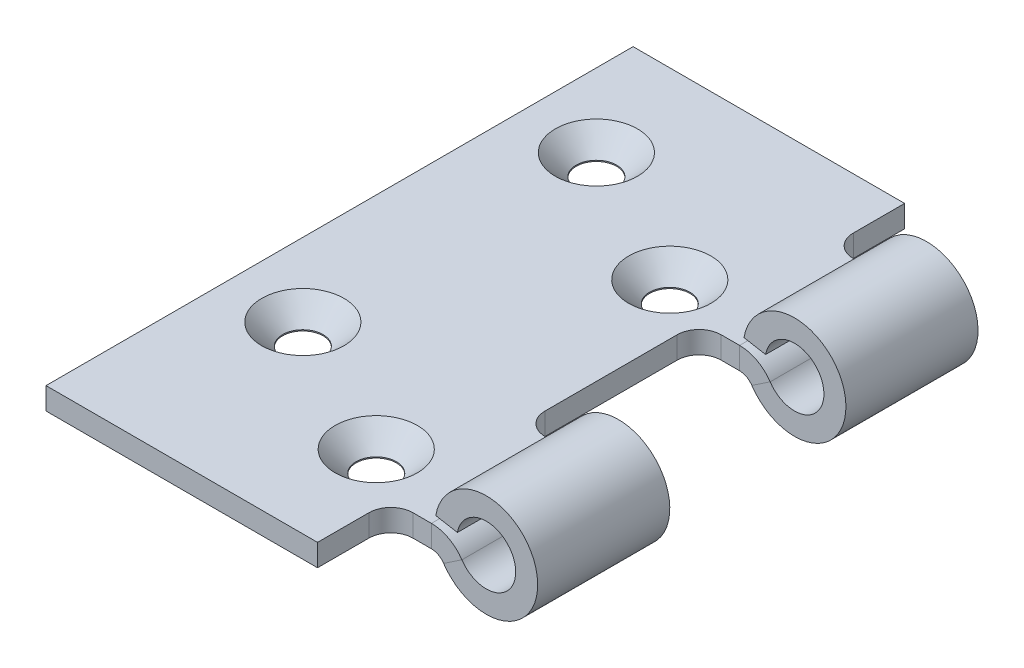
ISO-10303-21;
HEADER;
FILE_DESCRIPTION(('STEP AP214'),'2;1');
FILE_NAME('part.step','',(''),(''),'','','');
FILE_SCHEMA(('AUTOMOTIVE_DESIGN { 1 0 10303 214 1 1 1 1 }'));
ENDSEC;
DATA;
#1=APPLICATION_CONTEXT('core data for automotive mechanical design processes');
#2=APPLICATION_PROTOCOL_DEFINITION('international standard','automotive_design',2000,#1);
#3=PRODUCT_CONTEXT('',#1,'mechanical');
#4=PRODUCT('Part','Part','',(#3));
#5=PRODUCT_RELATED_PRODUCT_CATEGORY('part','',(#4));
#6=PRODUCT_DEFINITION_FORMATION('','',#4);
#7=PRODUCT_DEFINITION_CONTEXT('part definition',#1,'design');
#8=PRODUCT_DEFINITION('design','',#6,#7);
#9=PRODUCT_DEFINITION_SHAPE('','',#8);
#10=(LENGTH_UNIT() NAMED_UNIT(*) SI_UNIT(.MILLI.,.METRE.));
#11=(NAMED_UNIT(*) PLANE_ANGLE_UNIT() SI_UNIT($,.RADIAN.));
#12=(NAMED_UNIT(*) SI_UNIT($,.STERADIAN.) SOLID_ANGLE_UNIT());
#13=UNCERTAINTY_MEASURE_WITH_UNIT(LENGTH_MEASURE(1.E-05),#10,'distance_accuracy_value','');
#14=(GEOMETRIC_REPRESENTATION_CONTEXT(3) GLOBAL_UNCERTAINTY_ASSIGNED_CONTEXT((#13)) GLOBAL_UNIT_ASSIGNED_CONTEXT((#10,
#11,#12)) REPRESENTATION_CONTEXT('',''));
#15=CARTESIAN_POINT('',(0.,0.,0.));
#16=DIRECTION('',(0.,0.,1.));
#17=DIRECTION('',(1.,0.,0.));
#18=AXIS2_PLACEMENT_3D('',#15,#16,#17);
#19=CARTESIAN_POINT('',(-9.99999999999993,-6.99999999999995,-70.));
#20=DIRECTION('',(0.,0.,1.));
#21=DIRECTION('',(1.,0.,0.));
#22=AXIS2_PLACEMENT_3D('',#19,#20,#21);
#23=PLANE('',#22);
#24=CARTESIAN_POINT('',(0.,0.,-70.));
#25=DIRECTION('',(0.,0.,1.));
#26=DIRECTION('',(1.,0.,0.));
#27=AXIS2_PLACEMENT_3D('',#24,#25,#26);
#28=CIRCLE('',#27,7.00000000000001);
#29=CARTESIAN_POINT('',(-6.89365427108544,1.21553724366846,-70.));
#30=VERTEX_POINT('',#29);
#31=CARTESIAN_POINT('',(-5.82035593498165,-3.88888888888883,-70.));
#32=VERTEX_POINT('',#31);
#33=EDGE_CURVE('E276',#30,#32,#28,.F.);
#34=ORIENTED_EDGE('',*,*,#33,.T.);
#35=DIRECTION('',(0.831479419283094,0.555555555555562,0.));
#36=VECTOR('',#35,1.);
#37=CARTESIAN_POINT('',(-5.82035593498165,-3.88888888888883,-70.));
#38=LINE('',#37,#36);
#39=CARTESIAN_POINT('',(-3.32591767713236,-2.22222222222215,-70.));
#40=VERTEX_POINT('',#39);
#41=EDGE_CURVE('E12',#32,#40,#38,.T.);
#42=ORIENTED_EDGE('',*,*,#41,.T.);
#43=CARTESIAN_POINT('',(0.,0.,-70.));
#44=DIRECTION('',(0.,0.,1.));
#45=DIRECTION('',(1.,0.,0.));
#46=AXIS2_PLACEMENT_3D('',#43,#44,#45);
#47=CIRCLE('',#46,4.00000000000001);
#48=CARTESIAN_POINT('',(-3.9392310120488,0.694592710667715,-70.));
#49=VERTEX_POINT('',#48);
#50=EDGE_CURVE('E214',#49,#40,#47,.F.);
#51=ORIENTED_EDGE('',*,*,#50,.F.);
#52=DIRECTION('',(-0.984807753012211,0.173648177666914,0.));
#53=VECTOR('',#52,1.);
#54=CARTESIAN_POINT('',(-4.57147758948264,0.806074840729873,-70.));
#55=LINE('',#54,#53);
#56=EDGE_CURVE('E269',#49,#30,#55,.T.);
#57=ORIENTED_EDGE('',*,*,#56,.T.);
#58=EDGE_LOOP('',(#34,#42,#51,#57));
#59=FACE_BOUND('',#58,.T.);
#60=ADVANCED_FACE('F42',(#59),#23,.F.);
#61=DIRECTION('',(-1.,0.,0.));
#62=VECTOR('',#61,1.);
#63=CARTESIAN_POINT('',(-50.,0.,-70.));
#64=LINE('',#63,#62);
#65=CARTESIAN_POINT('',(-7.48331477354785,0.,-70.));
#66=VERTEX_POINT('',#65);
#67=CARTESIAN_POINT('',(-9.99999999999993,0.,-70.));
#68=VERTEX_POINT('',#67);
#69=EDGE_CURVE('E273',#66,#68,#64,.T.);
#70=ORIENTED_EDGE('',*,*,#69,.F.);
#71=DIRECTION('',(0.,-1.,0.));
#72=VECTOR('',#71,1.);
#73=CARTESIAN_POINT('',(-7.48331477354785,0.,-70.));
#74=LINE('',#73,#72);
#75=CARTESIAN_POINT('',(-7.48331477354785,-2.99999999999993,-70.));
#76=VERTEX_POINT('',#75);
#77=EDGE_CURVE('E50',#66,#76,#74,.T.);
#78=ORIENTED_EDGE('',*,*,#77,.T.);
#79=DIRECTION('',(1.,0.,0.));
#80=VECTOR('',#79,1.);
#81=CARTESIAN_POINT('',(-7.48331477354785,-2.99999999999993,-70.));
#82=LINE('',#81,#80);
#83=CARTESIAN_POINT('',(-9.99999999999993,-2.99999999999993,-70.));
#84=VERTEX_POINT('',#83);
#85=EDGE_CURVE('E281',#84,#76,#82,.T.);
#86=ORIENTED_EDGE('',*,*,#85,.F.);
#87=DIRECTION('',(0.,1.,0.));
#88=VECTOR('',#87,1.);
#89=CARTESIAN_POINT('',(-9.99999999999993,-6.99999999999995,-70.));
#90=LINE('',#89,#88);
#91=EDGE_CURVE('E520',#84,#68,#90,.T.);
#92=ORIENTED_EDGE('',*,*,#91,.T.);
#93=EDGE_LOOP('',(#70,#78,#86,#92));
#94=FACE_BOUND('',#93,.T.);
#95=ADVANCED_FACE('F423',(#94),#23,.F.);
#96=CARTESIAN_POINT('',(-9.99999999999993,-6.99999999999995,-52.));
#97=DIRECTION('',(0.,0.,-1.));
#98=DIRECTION('',(-1.,0.,0.));
#99=AXIS2_PLACEMENT_3D('',#96,#97,#98);
#100=PLANE('',#99);
#101=CARTESIAN_POINT('',(0.,0.,-52.));
#102=DIRECTION('',(0.,0.,-1.));
#103=DIRECTION('',(-1.,0.,0.));
#104=AXIS2_PLACEMENT_3D('',#101,#102,#103);
#105=CIRCLE('',#104,4.00000000000001);
#106=CARTESIAN_POINT('',(-3.32591767713236,-2.22222222222215,-52.));
#107=VERTEX_POINT('',#106);
#108=CARTESIAN_POINT('',(-3.9392310120488,0.694592710667715,-52.));
#109=VERTEX_POINT('',#108);
#110=EDGE_CURVE('E390',#107,#109,#105,.F.);
#111=ORIENTED_EDGE('',*,*,#110,.F.);
#112=DIRECTION('',(-0.831479419283094,-0.555555555555562,0.));
#113=VECTOR('',#112,1.);
#114=CARTESIAN_POINT('',(-3.32591767713236,-2.22222222222215,-52.));
#115=LINE('',#114,#113);
#116=CARTESIAN_POINT('',(-5.82035593498165,-3.88888888888883,-52.));
#117=VERTEX_POINT('',#116);
#118=EDGE_CURVE('E419',#107,#117,#115,.T.);
#119=ORIENTED_EDGE('',*,*,#118,.T.);
#120=CARTESIAN_POINT('',(0.,0.,-52.));
#121=DIRECTION('',(0.,0.,-1.));
#122=DIRECTION('',(-1.,0.,0.));
#123=AXIS2_PLACEMENT_3D('',#120,#121,#122);
#124=CIRCLE('',#123,7.00000000000001);
#125=CARTESIAN_POINT('',(-6.89365427108544,1.21553724366846,-52.));
#126=VERTEX_POINT('',#125);
#127=EDGE_CURVE('E245',#117,#126,#124,.F.);
#128=ORIENTED_EDGE('',*,*,#127,.T.);
#129=DIRECTION('',(0.984807753012211,-0.173648177666914,0.));
#130=VECTOR('',#129,1.);
#131=CARTESIAN_POINT('',(-4.57147758948264,0.806074840729873,-52.));
#132=LINE('',#131,#130);
#133=EDGE_CURVE('E231',#126,#109,#132,.T.);
#134=ORIENTED_EDGE('',*,*,#133,.T.);
#135=EDGE_LOOP('',(#111,#119,#128,#134));
#136=FACE_BOUND('',#135,.T.);
#137=ADVANCED_FACE('F447',(#136),#100,.F.);
#138=DIRECTION('',(-1.,0.,0.));
#139=VECTOR('',#138,1.);
#140=CARTESIAN_POINT('',(-7.48331477354785,-2.99999999999993,-52.));
#141=LINE('',#140,#139);
#142=CARTESIAN_POINT('',(-7.48331477354785,-2.99999999999993,-52.));
#143=VERTEX_POINT('',#142);
#144=CARTESIAN_POINT('',(-9.99999999999993,-2.99999999999993,-52.));
#145=VERTEX_POINT('',#144);
#146=EDGE_CURVE('E250',#143,#145,#141,.T.);
#147=ORIENTED_EDGE('',*,*,#146,.F.);
#148=DIRECTION('',(0.,1.,0.));
#149=VECTOR('',#148,1.);
#150=CARTESIAN_POINT('',(-7.48331477354785,-2.99999999999993,-52.));
#151=LINE('',#150,#149);
#152=CARTESIAN_POINT('',(-7.48331477354785,0.,-52.));
#153=VERTEX_POINT('',#152);
#154=EDGE_CURVE('E417',#143,#153,#151,.T.);
#155=ORIENTED_EDGE('',*,*,#154,.T.);
#156=DIRECTION('',(1.,0.,0.));
#157=VECTOR('',#156,1.);
#158=CARTESIAN_POINT('',(-50.,0.,-52.));
#159=LINE('',#158,#157);
#160=CARTESIAN_POINT('',(-9.99999999999993,0.,-52.));
#161=VERTEX_POINT('',#160);
#162=EDGE_CURVE('E242',#161,#153,#159,.T.);
#163=ORIENTED_EDGE('',*,*,#162,.F.);
#164=DIRECTION('',(0.,1.,0.));
#165=VECTOR('',#164,1.);
#166=CARTESIAN_POINT('',(-9.99999999999993,-6.99999999999995,-52.));
#167=LINE('',#166,#165);
#168=EDGE_CURVE('E467',#145,#161,#167,.T.);
#169=ORIENTED_EDGE('',*,*,#168,.F.);
#170=EDGE_LOOP('',(#147,#155,#163,#169));
#171=FACE_BOUND('',#170,.T.);
#172=ADVANCED_FACE('F466',(#171),#100,.F.);
#173=CARTESIAN_POINT('',(-9.99999999999993,-6.99999999999995,-28.));
#174=DIRECTION('',(0.,0.,1.));
#175=DIRECTION('',(1.,0.,0.));
#176=AXIS2_PLACEMENT_3D('',#173,#174,#175);
#177=PLANE('',#176);
#178=CARTESIAN_POINT('',(0.,0.,-28.));
#179=DIRECTION('',(0.,0.,1.));
#180=DIRECTION('',(1.,0.,0.));
#181=AXIS2_PLACEMENT_3D('',#178,#179,#180);
#182=CIRCLE('',#181,7.00000000000001);
#183=CARTESIAN_POINT('',(-6.89365427108544,1.21553724366846,-28.));
#184=VERTEX_POINT('',#183);
#185=CARTESIAN_POINT('',(-5.82035593498165,-3.88888888888883,-28.));
#186=VERTEX_POINT('',#185);
#187=EDGE_CURVE('E261',#184,#186,#182,.F.);
#188=ORIENTED_EDGE('',*,*,#187,.T.);
#189=DIRECTION('',(0.831479419283094,0.555555555555562,0.));
#190=VECTOR('',#189,1.);
#191=CARTESIAN_POINT('',(-5.82035593498165,-3.88888888888883,-28.));
#192=LINE('',#191,#190);
#193=CARTESIAN_POINT('',(-3.32591767713236,-2.22222222222215,-28.));
#194=VERTEX_POINT('',#193);
#195=EDGE_CURVE('E415',#186,#194,#192,.T.);
#196=ORIENTED_EDGE('',*,*,#195,.T.);
#197=CARTESIAN_POINT('',(0.,0.,-28.));
#198=DIRECTION('',(0.,0.,1.));
#199=DIRECTION('',(1.,0.,0.));
#200=AXIS2_PLACEMENT_3D('',#197,#198,#199);
#201=CIRCLE('',#200,4.00000000000001);
#202=CARTESIAN_POINT('',(-3.9392310120488,0.694592710667715,-28.));
#203=VERTEX_POINT('',#202);
#204=EDGE_CURVE('E393',#203,#194,#201,.F.);
#205=ORIENTED_EDGE('',*,*,#204,.F.);
#206=DIRECTION('',(-0.984807753012211,0.173648177666914,0.));
#207=VECTOR('',#206,1.);
#208=CARTESIAN_POINT('',(-4.57147758948264,0.806074840729873,-28.));
#209=LINE('',#208,#207);
#210=EDGE_CURVE('E253',#203,#184,#209,.T.);
#211=ORIENTED_EDGE('',*,*,#210,.T.);
#212=EDGE_LOOP('',(#188,#196,#205,#211));
#213=FACE_BOUND('',#212,.T.);
#214=ADVANCED_FACE('F501',(#213),#177,.F.);
#215=DIRECTION('',(-1.,0.,0.));
#216=VECTOR('',#215,1.);
#217=CARTESIAN_POINT('',(-50.,0.,-28.));
#218=LINE('',#217,#216);
#219=CARTESIAN_POINT('',(-7.48331477354785,0.,-28.));
#220=VERTEX_POINT('',#219);
#221=CARTESIAN_POINT('',(-9.99999999999993,0.,-28.));
#222=VERTEX_POINT('',#221);
#223=EDGE_CURVE('E258',#220,#222,#218,.T.);
#224=ORIENTED_EDGE('',*,*,#223,.F.);
#225=DIRECTION('',(0.,-1.,0.));
#226=VECTOR('',#225,1.);
#227=CARTESIAN_POINT('',(-7.48331477354785,0.,-28.));
#228=LINE('',#227,#226);
#229=CARTESIAN_POINT('',(-7.48331477354785,-2.99999999999993,-28.));
#230=VERTEX_POINT('',#229);
#231=EDGE_CURVE('E413',#220,#230,#228,.T.);
#232=ORIENTED_EDGE('',*,*,#231,.T.);
#233=DIRECTION('',(1.,0.,0.));
#234=VECTOR('',#233,1.);
#235=CARTESIAN_POINT('',(-7.48331477354785,-2.99999999999993,-28.));
#236=LINE('',#235,#234);
#237=CARTESIAN_POINT('',(-9.99999999999993,-2.99999999999993,-28.));
#238=VERTEX_POINT('',#237);
#239=EDGE_CURVE('E267',#238,#230,#236,.T.);
#240=ORIENTED_EDGE('',*,*,#239,.F.);
#241=DIRECTION('',(0.,1.,0.));
#242=VECTOR('',#241,1.);
#243=CARTESIAN_POINT('',(-9.99999999999993,-6.99999999999995,-28.));
#244=LINE('',#243,#242);
#245=EDGE_CURVE('E512',#238,#222,#244,.T.);
#246=ORIENTED_EDGE('',*,*,#245,.T.);
#247=EDGE_LOOP('',(#224,#232,#240,#246));
#248=FACE_BOUND('',#247,.T.);
#249=ADVANCED_FACE('F511',(#248),#177,.F.);
#250=CARTESIAN_POINT('',(-9.99999999999992,-6.99999999999995,-9.99999999999999));
#251=DIRECTION('',(0.,0.,-1.));
#252=DIRECTION('',(-1.,0.,0.));
#253=AXIS2_PLACEMENT_3D('',#250,#251,#252);
#254=PLANE('',#253);
#255=CARTESIAN_POINT('',(0.,0.,-9.99999999999999));
#256=DIRECTION('',(0.,0.,-1.));
#257=DIRECTION('',(-1.,0.,0.));
#258=AXIS2_PLACEMENT_3D('',#255,#256,#257);
#259=CIRCLE('',#258,4.00000000000001);
#260=CARTESIAN_POINT('',(-3.32591767713236,-2.22222222222215,-9.99999999999999));
#261=VERTEX_POINT('',#260);
#262=CARTESIAN_POINT('',(-3.9392310120488,0.694592710667715,-9.99999999999999));
#263=VERTEX_POINT('',#262);
#264=EDGE_CURVE('E388',#261,#263,#259,.F.);
#265=ORIENTED_EDGE('',*,*,#264,.F.);
#266=DIRECTION('',(-0.831479419283094,-0.555555555555562,0.));
#267=VECTOR('',#266,1.);
#268=CARTESIAN_POINT('',(-3.32591767713236,-2.22222222222215,-9.99999999999999));
#269=LINE('',#268,#267);
#270=CARTESIAN_POINT('',(-5.82035593498165,-3.88888888888883,-9.99999999999999));
#271=VERTEX_POINT('',#270);
#272=EDGE_CURVE('E411',#261,#271,#269,.T.);
#273=ORIENTED_EDGE('',*,*,#272,.T.);
#274=CARTESIAN_POINT('',(0.,0.,-9.99999999999999));
#275=DIRECTION('',(0.,0.,-1.));
#276=DIRECTION('',(-1.,0.,0.));
#277=AXIS2_PLACEMENT_3D('',#274,#275,#276);
#278=CIRCLE('',#277,7.00000000000001);
#279=CARTESIAN_POINT('',(-6.89365427108544,1.21553724366846,-9.99999999999999));
#280=VERTEX_POINT('',#279);
#281=EDGE_CURVE('E236',#271,#280,#278,.F.);
#282=ORIENTED_EDGE('',*,*,#281,.T.);
#283=DIRECTION('',(0.984807753012211,-0.173648177666914,0.));
#284=VECTOR('',#283,1.);
#285=CARTESIAN_POINT('',(-4.57147758948264,0.806074840729873,-9.99999999999999));
#286=LINE('',#285,#284);
#287=EDGE_CURVE('E63',#280,#263,#286,.T.);
#288=ORIENTED_EDGE('',*,*,#287,.T.);
#289=EDGE_LOOP('',(#265,#273,#282,#288));
#290=FACE_BOUND('',#289,.T.);
#291=ADVANCED_FACE('F488',(#290),#254,.F.);
#292=DIRECTION('',(-1.,0.,0.));
#293=VECTOR('',#292,1.);
#294=CARTESIAN_POINT('',(-7.48331477354785,-2.99999999999993,-9.99999999999999));
#295=LINE('',#294,#293);
#296=CARTESIAN_POINT('',(-7.48331477354785,-2.99999999999993,-9.99999999999998));
#297=VERTEX_POINT('',#296);
#298=CARTESIAN_POINT('',(-9.99999999999992,-2.99999999999993,-9.99999999999999));
#299=VERTEX_POINT('',#298);
#300=EDGE_CURVE('E219',#297,#299,#295,.T.);
#301=ORIENTED_EDGE('',*,*,#300,.F.);
#302=DIRECTION('',(0.,1.,0.));
#303=VECTOR('',#302,1.);
#304=CARTESIAN_POINT('',(-7.48331477354785,-2.99999999999993,-9.99999999999998));
#305=LINE('',#304,#303);
#306=CARTESIAN_POINT('',(-7.48331477354785,0.,-9.99999999999998));
#307=VERTEX_POINT('',#306);
#308=EDGE_CURVE('E409',#297,#307,#305,.T.);
#309=ORIENTED_EDGE('',*,*,#308,.T.);
#310=DIRECTION('',(1.,0.,0.));
#311=VECTOR('',#310,1.);
#312=CARTESIAN_POINT('',(-50.,0.,-9.99999999999999));
#313=LINE('',#312,#311);
#314=CARTESIAN_POINT('',(-9.99999999999992,0.,-9.99999999999999));
#315=VERTEX_POINT('',#314);
#316=EDGE_CURVE('E222',#315,#307,#313,.T.);
#317=ORIENTED_EDGE('',*,*,#316,.F.);
#318=DIRECTION('',(0.,1.,0.));
#319=VECTOR('',#318,1.);
#320=CARTESIAN_POINT('',(-9.99999999999992,-6.99999999999995,-9.99999999999999));
#321=LINE('',#320,#319);
#322=EDGE_CURVE('E206',#299,#315,#321,.T.);
#323=ORIENTED_EDGE('',*,*,#322,.F.);
#324=EDGE_LOOP('',(#301,#309,#317,#323));
#325=FACE_BOUND('',#324,.T.);
#326=ADVANCED_FACE('F218',(#325),#254,.F.);
#327=CARTESIAN_POINT('',(-7.48331477354785,-4.99999999999993,-186.827428854915));
#328=DIRECTION('',(0.,0.,1.));
#329=DIRECTION('',(1.,0.,0.));
#330=AXIS2_PLACEMENT_3D('',#327,#328,#329);
#331=CYLINDRICAL_SURFACE('',#330,5.);
#332=CARTESIAN_POINT('',(-7.48331477354785,-4.99999999999993,-28.));
#333=DIRECTION('',(0.,0.,1.));
#334=DIRECTION('',(1.,0.,0.));
#335=AXIS2_PLACEMENT_3D('',#332,#333,#334);
#336=CIRCLE('',#335,5.);
#337=EDGE_CURVE('E255',#220,#194,#336,.F.);
#338=ORIENTED_EDGE('',*,*,#337,.F.);
#339=DIRECTION('',(0.,0.,1.));
#340=VECTOR('',#339,1.);
#341=CARTESIAN_POINT('',(-7.48331477354785,0.,-80.));
#342=LINE('',#341,#340);
#343=EDGE_CURVE('E348',#220,#307,#342,.T.);
#344=ORIENTED_EDGE('',*,*,#343,.T.);
#345=CARTESIAN_POINT('',(-7.48331477354785,-4.99999999999993,-9.99999999999998));
#346=DIRECTION('',(0.,0.,-1.));
#347=DIRECTION('',(-1.,0.,0.));
#348=AXIS2_PLACEMENT_3D('',#345,#346,#347);
#349=CIRCLE('',#348,5.);
#350=EDGE_CURVE('E483',#261,#307,#349,.F.);
#351=ORIENTED_EDGE('',*,*,#350,.F.);
#352=DIRECTION('',(0.,0.,-1.));
#353=VECTOR('',#352,1.);
#354=CARTESIAN_POINT('',(-3.32591767713236,-2.22222222222215,0.));
#355=LINE('',#354,#353);
#356=EDGE_CURVE('E377',#261,#194,#355,.T.);
#357=ORIENTED_EDGE('',*,*,#356,.T.);
#358=EDGE_LOOP('',(#338,#344,#351,#357));
#359=FACE_BOUND('',#358,.T.);
#360=ADVANCED_FACE('F545',(#359),#331,.T.);
#361=CARTESIAN_POINT('',(-7.48331477354785,-4.99999999999993,-186.827428854915));
#362=DIRECTION('',(0.,0.,1.));
#363=DIRECTION('',(1.,0.,0.));
#364=AXIS2_PLACEMENT_3D('',#361,#362,#363);
#365=CYLINDRICAL_SURFACE('',#364,2.);
#366=DIRECTION('',(0.,0.,1.));
#367=VECTOR('',#366,1.);
#368=CARTESIAN_POINT('',(-7.48331477354785,-2.99999999999993,-80.));
#369=LINE('',#368,#367);
#370=EDGE_CURVE('E230',#230,#297,#369,.T.);
#371=ORIENTED_EDGE('',*,*,#370,.F.);
#372=CARTESIAN_POINT('',(-7.48331477354785,-4.99999999999993,-28.));
#373=DIRECTION('',(0.,0.,1.));
#374=DIRECTION('',(1.,0.,0.));
#375=AXIS2_PLACEMENT_3D('',#372,#373,#374);
#376=CIRCLE('',#375,2.);
#377=EDGE_CURVE('E264',#230,#186,#376,.F.);
#378=ORIENTED_EDGE('',*,*,#377,.T.);
#379=DIRECTION('',(0.,0.,-1.));
#380=VECTOR('',#379,1.);
#381=CARTESIAN_POINT('',(-5.82035593498164,-3.88888888888883,0.));
#382=LINE('',#381,#380);
#383=EDGE_CURVE('E376',#271,#186,#382,.T.);
#384=ORIENTED_EDGE('',*,*,#383,.F.);
#385=CARTESIAN_POINT('',(-7.48331477354785,-4.99999999999993,-9.99999999999998));
#386=DIRECTION('',(0.,0.,-1.));
#387=DIRECTION('',(-1.,0.,0.));
#388=AXIS2_PLACEMENT_3D('',#385,#386,#387);
#389=CIRCLE('',#388,2.);
#390=EDGE_CURVE('E232',#271,#297,#389,.F.);
#391=ORIENTED_EDGE('',*,*,#390,.T.);
#392=EDGE_LOOP('',(#371,#378,#384,#391));
#393=FACE_BOUND('',#392,.T.);
#394=ADVANCED_FACE('F504',(#393),#365,.F.);
#395=CARTESIAN_POINT('',(-4.57147758948264,0.806074840729873,-40.));
#396=DIRECTION('',(-0.173648177666914,-0.984807753012211,0.));
#397=DIRECTION('',(0.,0.,1.));
#398=AXIS2_PLACEMENT_3D('',#395,#396,#397);
#399=PLANE('',#398);
#400=ORIENTED_EDGE('',*,*,#210,.F.);
#401=DIRECTION('',(0.,0.,-1.));
#402=VECTOR('',#401,1.);
#403=CARTESIAN_POINT('',(-3.9392310120488,0.694592710667715,103.655910016656));
#404=LINE('',#403,#402);
#405=EDGE_CURVE('E342',#203,#263,#404,.F.);
#406=ORIENTED_EDGE('',*,*,#405,.T.);
#407=ORIENTED_EDGE('',*,*,#287,.F.);
#408=DIRECTION('',(0.,0.,-1.));
#409=VECTOR('',#408,1.);
#410=CARTESIAN_POINT('',(-6.89365427108544,1.21553724366846,103.655910016656));
#411=LINE('',#410,#409);
#412=EDGE_CURVE('E337',#184,#280,#411,.F.);
#413=ORIENTED_EDGE('',*,*,#412,.F.);
#414=EDGE_LOOP('',(#400,#406,#407,#413));
#415=FACE_BOUND('',#414,.T.);
#416=ADVANCED_FACE('F496',(#415),#399,.T.);
#417=CARTESIAN_POINT('',(0.,0.,103.655910016656));
#418=DIRECTION('',(0.,0.,-1.));
#419=DIRECTION('',(-1.,0.,0.));
#420=AXIS2_PLACEMENT_3D('',#417,#418,#419);
#421=CYLINDRICAL_SURFACE('',#420,7.00000000000001);
#422=ORIENTED_EDGE('',*,*,#33,.F.);
#423=EDGE_CURVE('E340',#30,#126,#411,.F.);
#424=ORIENTED_EDGE('',*,*,#423,.T.);
#425=ORIENTED_EDGE('',*,*,#127,.F.);
#426=EDGE_CURVE('E373',#117,#32,#382,.T.);
#427=ORIENTED_EDGE('',*,*,#426,.T.);
#428=EDGE_LOOP('',(#422,#424,#425,#427));
#429=FACE_BOUND('',#428,.T.);
#430=ADVANCED_FACE('F443',(#429),#421,.T.);
#431=CARTESIAN_POINT('',(0.,0.,103.655910016656));
#432=DIRECTION('',(0.,0.,-1.));
#433=DIRECTION('',(-1.,0.,0.));
#434=AXIS2_PLACEMENT_3D('',#431,#432,#433);
#435=CYLINDRICAL_SURFACE('',#434,4.00000000000001);
#436=ORIENTED_EDGE('',*,*,#405,.F.);
#437=ORIENTED_EDGE('',*,*,#204,.T.);
#438=ORIENTED_EDGE('',*,*,#356,.F.);
#439=ORIENTED_EDGE('',*,*,#264,.T.);
#440=EDGE_LOOP('',(#436,#437,#438,#439));
#441=FACE_BOUND('',#440,.T.);
#442=ADVANCED_FACE('F549',(#441),#435,.F.);
#443=CARTESIAN_POINT('',(-50.,0.,-80.));
#444=DIRECTION('',(0.,-1.,0.));
#445=DIRECTION('',(1.,0.,0.));
#446=AXIS2_PLACEMENT_3D('',#443,#444,#445);
#447=PLANE('',#446);
#448=CARTESIAN_POINT('',(-40.,0.,-65.));
#449=DIRECTION('',(0.,1.,0.));
#450=DIRECTION('',(0.,0.,1.));
#451=AXIS2_PLACEMENT_3D('',#448,#449,#450);
#452=CIRCLE('',#451,5.6);
#453=CARTESIAN_POINT('',(-40.,0.,-59.4));
#454=VERTEX_POINT('',#453);
#455=EDGE_CURVE('E309',#454,#454,#452,.T.);
#456=ORIENTED_EDGE('',*,*,#455,.F.);
#457=EDGE_LOOP('',(#456));
#458=FACE_BOUND('',#457,.T.);
#459=CARTESIAN_POINT('',(-20.,0.,-55.));
#460=DIRECTION('',(0.,1.,0.));
#461=DIRECTION('',(0.,0.,1.));
#462=AXIS2_PLACEMENT_3D('',#459,#460,#461);
#463=CIRCLE('',#462,5.6);
#464=CARTESIAN_POINT('',(-20.,0.,-49.4));
#465=VERTEX_POINT('',#464);
#466=EDGE_CURVE('E316',#465,#465,#463,.T.);
#467=ORIENTED_EDGE('',*,*,#466,.F.);
#468=EDGE_LOOP('',(#467));
#469=FACE_BOUND('',#468,.T.);
#470=CARTESIAN_POINT('',(-40.,0.,-25.));
#471=DIRECTION('',(0.,1.,0.));
#472=DIRECTION('',(0.,0.,1.));
#473=AXIS2_PLACEMENT_3D('',#470,#471,#472);
#474=CIRCLE('',#473,5.6);
#475=CARTESIAN_POINT('',(-40.,0.,-19.4));
#476=VERTEX_POINT('',#475);
#477=EDGE_CURVE('E323',#476,#476,#474,.T.);
#478=ORIENTED_EDGE('',*,*,#477,.F.);
#479=EDGE_LOOP('',(#478));
#480=FACE_BOUND('',#479,.T.);
#481=CARTESIAN_POINT('',(-20.,0.,-15.));
#482=DIRECTION('',(0.,1.,0.));
#483=DIRECTION('',(0.,0.,1.));
#484=AXIS2_PLACEMENT_3D('',#481,#482,#483);
#485=CIRCLE('',#484,5.6);
#486=CARTESIAN_POINT('',(-20.,0.,-9.4));
#487=VERTEX_POINT('',#486);
#488=EDGE_CURVE('E330',#487,#487,#485,.T.);
#489=ORIENTED_EDGE('',*,*,#488,.F.);
#490=EDGE_LOOP('',(#489));
#491=FACE_BOUND('',#490,.T.);
#492=CARTESIAN_POINT('',(-9.99999999999995,0.,-73.));
#493=DIRECTION('',(0.,-1.,0.));
#494=DIRECTION('',(1.,0.,0.));
#495=AXIS2_PLACEMENT_3D('',#492,#493,#494);
#496=CIRCLE('',#495,3.);
#497=CARTESIAN_POINT('',(-13.,0.,-73.0000000000001));
#498=VERTEX_POINT('',#497);
#499=EDGE_CURVE('E306',#68,#498,#496,.T.);
#500=ORIENTED_EDGE('',*,*,#499,.T.);
#501=DIRECTION('',(0.,0.,-1.));
#502=VECTOR('',#501,1.);
#503=CARTESIAN_POINT('',(-12.9999999999999,0.,-80.));
#504=LINE('',#503,#502);
#505=CARTESIAN_POINT('',(-12.9999999999999,0.,-80.));
#506=VERTEX_POINT('',#505);
#507=EDGE_CURVE('E287',#498,#506,#504,.T.);
#508=ORIENTED_EDGE('',*,*,#507,.T.);
#509=DIRECTION('',(1.,0.,0.));
#510=VECTOR('',#509,1.);
#511=CARTESIAN_POINT('',(-50.,0.,-80.));
#512=LINE('',#511,#510);
#513=CARTESIAN_POINT('',(-50.,0.,-80.));
#514=VERTEX_POINT('',#513);
#515=EDGE_CURVE('E352',#514,#506,#512,.T.);
#516=ORIENTED_EDGE('',*,*,#515,.F.);
#517=DIRECTION('',(0.,0.,1.));
#518=VECTOR('',#517,1.);
#519=CARTESIAN_POINT('',(-50.,0.,-80.));
#520=LINE('',#519,#518);
#521=CARTESIAN_POINT('',(-50.,0.,0.));
#522=VERTEX_POINT('',#521);
#523=EDGE_CURVE('E355',#514,#522,#520,.T.);
#524=ORIENTED_EDGE('',*,*,#523,.T.);
#525=DIRECTION('',(1.,0.,0.));
#526=VECTOR('',#525,1.);
#527=CARTESIAN_POINT('',(-50.,0.,0.));
#528=LINE('',#527,#526);
#529=CARTESIAN_POINT('',(-12.9999999999999,0.,0.));
#530=VERTEX_POINT('',#529);
#531=EDGE_CURVE('E345',#522,#530,#528,.T.);
#532=ORIENTED_EDGE('',*,*,#531,.T.);
#533=DIRECTION('',(0.,0.,-1.));
#534=VECTOR('',#533,1.);
#535=CARTESIAN_POINT('',(-12.9999999999999,0.,-80.));
#536=LINE('',#535,#534);
#537=CARTESIAN_POINT('',(-12.9999999999999,0.,-6.99999999999998));
#538=VERTEX_POINT('',#537);
#539=EDGE_CURVE('E292',#530,#538,#536,.T.);
#540=ORIENTED_EDGE('',*,*,#539,.T.);
#541=CARTESIAN_POINT('',(-9.99999999999994,0.,-7.));
#542=DIRECTION('',(0.,-1.,0.));
#543=DIRECTION('',(1.,0.,0.));
#544=AXIS2_PLACEMENT_3D('',#541,#542,#543);
#545=CIRCLE('',#544,3.);
#546=EDGE_CURVE('E295',#538,#315,#545,.T.);
#547=ORIENTED_EDGE('',*,*,#546,.T.);
#548=ORIENTED_EDGE('',*,*,#316,.T.);
#549=ORIENTED_EDGE('',*,*,#343,.F.);
#550=ORIENTED_EDGE('',*,*,#223,.T.);
#551=CARTESIAN_POINT('',(-9.99999999999995,0.,-31.));
#552=DIRECTION('',(0.,-1.,0.));
#553=DIRECTION('',(1.,0.,0.));
#554=AXIS2_PLACEMENT_3D('',#551,#552,#553);
#555=CIRCLE('',#554,3.);
#556=CARTESIAN_POINT('',(-12.9999999999999,0.,-31.));
#557=VERTEX_POINT('',#556);
#558=EDGE_CURVE('E303',#222,#557,#555,.T.);
#559=ORIENTED_EDGE('',*,*,#558,.T.);
#560=DIRECTION('',(0.,0.,-1.));
#561=VECTOR('',#560,1.);
#562=CARTESIAN_POINT('',(-12.9999999999999,0.,-80.));
#563=LINE('',#562,#561);
#564=CARTESIAN_POINT('',(-12.9999999999999,0.,-49.));
#565=VERTEX_POINT('',#564);
#566=EDGE_CURVE('E300',#557,#565,#563,.T.);
#567=ORIENTED_EDGE('',*,*,#566,.T.);
#568=CARTESIAN_POINT('',(-9.99999999999995,0.,-49.));
#569=DIRECTION('',(0.,-1.,0.));
#570=DIRECTION('',(1.,0.,0.));
#571=AXIS2_PLACEMENT_3D('',#568,#569,#570);
#572=CIRCLE('',#571,3.);
#573=EDGE_CURVE('E297',#565,#161,#572,.T.);
#574=ORIENTED_EDGE('',*,*,#573,.T.);
#575=ORIENTED_EDGE('',*,*,#162,.T.);
#576=EDGE_CURVE('E351',#66,#153,#342,.T.);
#577=ORIENTED_EDGE('',*,*,#576,.F.);
#578=ORIENTED_EDGE('',*,*,#69,.T.);
#579=EDGE_LOOP('',(#500,#508,#516,#524,#532,#540,#547,#548,#549,#550,#559,#567,#574,#575,#577,#578));
#580=FACE_BOUND('',#579,.T.);
#581=ADVANCED_FACE('F462',(#458,#469,#480,#491,#580),#447,.F.);
#582=CARTESIAN_POINT('',(-7.48331477354785,-2.99999999999993,-80.));
#583=DIRECTION('',(0.,1.,0.));
#584=DIRECTION('',(-1.,0.,0.));
#585=AXIS2_PLACEMENT_3D('',#582,#583,#584);
#586=PLANE('',#585);
#587=DIRECTION('',(-1.,0.,0.));
#588=VECTOR('',#587,1.);
#589=CARTESIAN_POINT('',(-7.48331477354785,-2.99999999999993,-80.));
#590=LINE('',#589,#588);
#591=CARTESIAN_POINT('',(-12.9999999999999,-2.99999999999992,-80.));
#592=VERTEX_POINT('',#591);
#593=CARTESIAN_POINT('',(-50.,-2.99999999999993,-80.));
#594=VERTEX_POINT('',#593);
#595=EDGE_CURVE('E362',#592,#594,#590,.T.);
#596=ORIENTED_EDGE('',*,*,#595,.F.);
#597=DIRECTION('',(0.,0.,1.));
#598=VECTOR('',#597,1.);
#599=CARTESIAN_POINT('',(-12.9999999999999,-2.99999999999993,-80.));
#600=LINE('',#599,#598);
#601=CARTESIAN_POINT('',(-13.,-2.99999999999993,-73.0000000000001));
#602=VERTEX_POINT('',#601);
#603=EDGE_CURVE('E284',#592,#602,#600,.T.);
#604=ORIENTED_EDGE('',*,*,#603,.T.);
#605=CARTESIAN_POINT('',(-9.99999999999995,-2.99999999999993,-73.));
#606=DIRECTION('',(0.,1.,0.));
#607=DIRECTION('',(-1.,0.,0.));
#608=AXIS2_PLACEMENT_3D('',#605,#606,#607);
#609=CIRCLE('',#608,3.);
#610=EDGE_CURVE('E406',#602,#84,#609,.T.);
#611=ORIENTED_EDGE('',*,*,#610,.T.);
#612=ORIENTED_EDGE('',*,*,#85,.T.);
#613=EDGE_CURVE('E365',#76,#143,#369,.T.);
#614=ORIENTED_EDGE('',*,*,#613,.T.);
#615=ORIENTED_EDGE('',*,*,#146,.T.);
#616=CARTESIAN_POINT('',(-9.99999999999995,-2.99999999999993,-49.));
#617=DIRECTION('',(0.,1.,0.));
#618=DIRECTION('',(-1.,0.,0.));
#619=AXIS2_PLACEMENT_3D('',#616,#617,#618);
#620=CIRCLE('',#619,3.);
#621=CARTESIAN_POINT('',(-12.9999999999999,-2.99999999999993,-49.));
#622=VERTEX_POINT('',#621);
#623=EDGE_CURVE('E213',#145,#622,#620,.T.);
#624=ORIENTED_EDGE('',*,*,#623,.T.);
#625=DIRECTION('',(0.,0.,1.));
#626=VECTOR('',#625,1.);
#627=CARTESIAN_POINT('',(-12.9999999999999,-2.99999999999993,-80.));
#628=LINE('',#627,#626);
#629=CARTESIAN_POINT('',(-12.9999999999999,-2.99999999999993,-31.));
#630=VERTEX_POINT('',#629);
#631=EDGE_CURVE('E400',#622,#630,#628,.T.);
#632=ORIENTED_EDGE('',*,*,#631,.T.);
#633=CARTESIAN_POINT('',(-9.99999999999995,-2.99999999999993,-31.));
#634=DIRECTION('',(0.,1.,0.));
#635=DIRECTION('',(-1.,0.,0.));
#636=AXIS2_PLACEMENT_3D('',#633,#634,#635);
#637=CIRCLE('',#636,3.);
#638=EDGE_CURVE('E403',#630,#238,#637,.T.);
#639=ORIENTED_EDGE('',*,*,#638,.T.);
#640=ORIENTED_EDGE('',*,*,#239,.T.);
#641=ORIENTED_EDGE('',*,*,#370,.T.);
#642=ORIENTED_EDGE('',*,*,#300,.T.);
#643=CARTESIAN_POINT('',(-9.99999999999994,-2.99999999999993,-7.));
#644=DIRECTION('',(0.,1.,0.));
#645=DIRECTION('',(-1.,0.,0.));
#646=AXIS2_PLACEMENT_3D('',#643,#644,#645);
#647=CIRCLE('',#646,3.);
#648=CARTESIAN_POINT('',(-12.9999999999999,-2.99999999999993,-6.99999999999998));
#649=VERTEX_POINT('',#648);
#650=EDGE_CURVE('E203',#299,#649,#647,.T.);
#651=ORIENTED_EDGE('',*,*,#650,.T.);
#652=DIRECTION('',(0.,0.,1.));
#653=VECTOR('',#652,1.);
#654=CARTESIAN_POINT('',(-12.9999999999999,-2.99999999999993,-80.));
#655=LINE('',#654,#653);
#656=CARTESIAN_POINT('',(-12.9999999999999,-2.99999999999992,0.));
#657=VERTEX_POINT('',#656);
#658=EDGE_CURVE('E290',#649,#657,#655,.T.);
#659=ORIENTED_EDGE('',*,*,#658,.T.);
#660=DIRECTION('',(-1.,0.,0.));
#661=VECTOR('',#660,1.);
#662=CARTESIAN_POINT('',(-7.48331477354785,-2.99999999999993,0.));
#663=LINE('',#662,#661);
#664=CARTESIAN_POINT('',(-50.,-2.99999999999993,0.));
#665=VERTEX_POINT('',#664);
#666=EDGE_CURVE('E357',#657,#665,#663,.T.);
#667=ORIENTED_EDGE('',*,*,#666,.T.);
#668=DIRECTION('',(0.,0.,1.));
#669=VECTOR('',#668,1.);
#670=CARTESIAN_POINT('',(-50.,-2.99999999999993,-80.));
#671=LINE('',#670,#669);
#672=EDGE_CURVE('E359',#594,#665,#671,.T.);
#673=ORIENTED_EDGE('',*,*,#672,.F.);
#674=EDGE_LOOP('',(#596,#604,#611,#612,#614,#615,#624,#632,#639,#640,#641,#642,#651,#659,#667,#673));
#675=FACE_BOUND('',#674,.T.);
#676=CARTESIAN_POINT('',(-40.,-2.99999999999993,-65.));
#677=DIRECTION('',(0.,1.,0.));
#678=DIRECTION('',(-1.,0.,0.));
#679=AXIS2_PLACEMENT_3D('',#676,#677,#678);
#680=CIRCLE('',#679,2.74999999999999);
#681=CARTESIAN_POINT('',(-42.75,-2.99999999999993,-65.));
#682=VERTEX_POINT('',#681);
#683=EDGE_CURVE('E315',#682,#682,#680,.T.);
#684=ORIENTED_EDGE('',*,*,#683,.T.);
#685=EDGE_LOOP('',(#684));
#686=FACE_BOUND('',#685,.T.);
#687=CARTESIAN_POINT('',(-20.,-2.99999999999993,-55.));
#688=DIRECTION('',(0.,1.,0.));
#689=DIRECTION('',(-1.,0.,0.));
#690=AXIS2_PLACEMENT_3D('',#687,#688,#689);
#691=CIRCLE('',#690,2.74999999999999);
#692=CARTESIAN_POINT('',(-22.75,-2.99999999999993,-55.));
#693=VERTEX_POINT('',#692);
#694=EDGE_CURVE('E322',#693,#693,#691,.T.);
#695=ORIENTED_EDGE('',*,*,#694,.T.);
#696=EDGE_LOOP('',(#695));
#697=FACE_BOUND('',#696,.T.);
#698=CARTESIAN_POINT('',(-40.,-2.99999999999993,-25.));
#699=DIRECTION('',(0.,1.,0.));
#700=DIRECTION('',(-1.,0.,0.));
#701=AXIS2_PLACEMENT_3D('',#698,#699,#700);
#702=CIRCLE('',#701,2.74999999999999);
#703=CARTESIAN_POINT('',(-42.75,-2.99999999999993,-25.));
#704=VERTEX_POINT('',#703);
#705=EDGE_CURVE('E329',#704,#704,#702,.T.);
#706=ORIENTED_EDGE('',*,*,#705,.T.);
#707=EDGE_LOOP('',(#706));
#708=FACE_BOUND('',#707,.T.);
#709=CARTESIAN_POINT('',(-20.,-2.99999999999993,-15.));
#710=DIRECTION('',(0.,1.,0.));
#711=DIRECTION('',(-1.,0.,0.));
#712=AXIS2_PLACEMENT_3D('',#709,#710,#711);
#713=CIRCLE('',#712,2.74999999999999);
#714=CARTESIAN_POINT('',(-22.75,-2.99999999999993,-15.));
#715=VERTEX_POINT('',#714);
#716=EDGE_CURVE('E336',#715,#715,#713,.T.);
#717=ORIENTED_EDGE('',*,*,#716,.T.);
#718=EDGE_LOOP('',(#717));
#719=FACE_BOUND('',#718,.T.);
#720=ADVANCED_FACE('F226',(#675,#686,#697,#708,#719),#586,.F.);
#721=CARTESIAN_POINT('',(-7.48331477354786,-181.192367638874,0.));
#722=DIRECTION('',(0.,0.,-1.));
#723=DIRECTION('',(-1.,0.,0.));
#724=AXIS2_PLACEMENT_3D('',#721,#722,#723);
#725=PLANE('',#724);
#726=ORIENTED_EDGE('',*,*,#666,.F.);
#727=DIRECTION('',(0.,1.,0.));
#728=VECTOR('',#727,1.);
#729=CARTESIAN_POINT('',(-12.9999999999999,-6.99999999999995,0.));
#730=LINE('',#729,#728);
#731=EDGE_CURVE('E473',#657,#530,#730,.T.);
#732=ORIENTED_EDGE('',*,*,#731,.T.);
#733=ORIENTED_EDGE('',*,*,#531,.F.);
#734=DIRECTION('',(0.,1.,0.));
#735=VECTOR('',#734,1.);
#736=CARTESIAN_POINT('',(-50.,-181.192367638874,0.));
#737=LINE('',#736,#735);
#738=EDGE_CURVE('E369',#665,#522,#737,.T.);
#739=ORIENTED_EDGE('',*,*,#738,.F.);
#740=EDGE_LOOP('',(#726,#732,#733,#739));
#741=FACE_BOUND('',#740,.T.);
#742=ADVANCED_FACE('F44',(#741),#725,.F.);
#743=CARTESIAN_POINT('',(-50.,-181.192367638874,-80.));
#744=DIRECTION('',(-1.,0.,0.));
#745=DIRECTION('',(0.,-1.,0.));
#746=AXIS2_PLACEMENT_3D('',#743,#744,#745);
#747=PLANE('',#746);
#748=ORIENTED_EDGE('',*,*,#523,.F.);
#749=DIRECTION('',(0.,1.,0.));
#750=VECTOR('',#749,1.);
#751=CARTESIAN_POINT('',(-50.,-181.192367638874,-80.));
#752=LINE('',#751,#750);
#753=EDGE_CURVE('E366',#594,#514,#752,.T.);
#754=ORIENTED_EDGE('',*,*,#753,.F.);
#755=ORIENTED_EDGE('',*,*,#672,.T.);
#756=ORIENTED_EDGE('',*,*,#738,.T.);
#757=EDGE_LOOP('',(#748,#754,#755,#756));
#758=FACE_BOUND('',#757,.T.);
#759=ADVANCED_FACE('F534',(#758),#747,.T.);
#760=CARTESIAN_POINT('',(-7.48331477354786,-181.192367638874,-80.));
#761=DIRECTION('',(0.,0.,-1.));
#762=DIRECTION('',(-1.,0.,0.));
#763=AXIS2_PLACEMENT_3D('',#760,#761,#762);
#764=PLANE('',#763);
#765=DIRECTION('',(0.,1.,0.));
#766=VECTOR('',#765,1.);
#767=CARTESIAN_POINT('',(-12.9999999999999,-6.99999999999995,-80.));
#768=LINE('',#767,#766);
#769=EDGE_CURVE('E484',#592,#506,#768,.T.);
#770=ORIENTED_EDGE('',*,*,#769,.F.);
#771=ORIENTED_EDGE('',*,*,#595,.T.);
#772=ORIENTED_EDGE('',*,*,#753,.T.);
#773=ORIENTED_EDGE('',*,*,#515,.T.);
#774=EDGE_LOOP('',(#770,#771,#772,#773));
#775=FACE_BOUND('',#774,.T.);
#776=ADVANCED_FACE('F530',(#775),#764,.T.);
#777=CARTESIAN_POINT('',(-7.48331477354785,-4.99999999999993,-70.));
#778=DIRECTION('',(0.,0.,1.));
#779=DIRECTION('',(1.,0.,0.));
#780=AXIS2_PLACEMENT_3D('',#777,#778,#779);
#781=CIRCLE('',#780,5.);
#782=EDGE_CURVE('E271',#66,#40,#781,.F.);
#783=ORIENTED_EDGE('',*,*,#782,.F.);
#784=ORIENTED_EDGE('',*,*,#576,.T.);
#785=CARTESIAN_POINT('',(-7.48331477354785,-4.99999999999993,-52.));
#786=DIRECTION('',(0.,0.,-1.));
#787=DIRECTION('',(-1.,0.,0.));
#788=AXIS2_PLACEMENT_3D('',#785,#786,#787);
#789=CIRCLE('',#788,5.);
#790=EDGE_CURVE('E234',#107,#153,#789,.F.);
#791=ORIENTED_EDGE('',*,*,#790,.F.);
#792=EDGE_CURVE('E372',#107,#40,#355,.T.);
#793=ORIENTED_EDGE('',*,*,#792,.T.);
#794=EDGE_LOOP('',(#783,#784,#791,#793));
#795=FACE_BOUND('',#794,.T.);
#796=ADVANCED_FACE('F459',(#795),#331,.T.);
#797=ORIENTED_EDGE('',*,*,#613,.F.);
#798=CARTESIAN_POINT('',(-7.48331477354785,-4.99999999999993,-70.));
#799=DIRECTION('',(0.,0.,1.));
#800=DIRECTION('',(1.,0.,0.));
#801=AXIS2_PLACEMENT_3D('',#798,#799,#800);
#802=CIRCLE('',#801,2.);
#803=EDGE_CURVE('E278',#76,#32,#802,.F.);
#804=ORIENTED_EDGE('',*,*,#803,.T.);
#805=ORIENTED_EDGE('',*,*,#426,.F.);
#806=CARTESIAN_POINT('',(-7.48331477354785,-4.99999999999993,-52.));
#807=DIRECTION('',(0.,0.,-1.));
#808=DIRECTION('',(-1.,0.,0.));
#809=AXIS2_PLACEMENT_3D('',#806,#807,#808);
#810=CIRCLE('',#809,2.);
#811=EDGE_CURVE('E247',#117,#143,#810,.F.);
#812=ORIENTED_EDGE('',*,*,#811,.T.);
#813=EDGE_LOOP('',(#797,#804,#805,#812));
#814=FACE_BOUND('',#813,.T.);
#815=ADVANCED_FACE('F433',(#814),#365,.F.);
#816=ORIENTED_EDGE('',*,*,#56,.F.);
#817=EDGE_CURVE('E341',#49,#109,#404,.F.);
#818=ORIENTED_EDGE('',*,*,#817,.T.);
#819=ORIENTED_EDGE('',*,*,#133,.F.);
#820=ORIENTED_EDGE('',*,*,#423,.F.);
#821=EDGE_LOOP('',(#816,#818,#819,#820));
#822=FACE_BOUND('',#821,.T.);
#823=ADVANCED_FACE('F451',(#822),#399,.T.);
#824=ORIENTED_EDGE('',*,*,#187,.F.);
#825=ORIENTED_EDGE('',*,*,#412,.T.);
#826=ORIENTED_EDGE('',*,*,#281,.F.);
#827=ORIENTED_EDGE('',*,*,#383,.T.);
#828=EDGE_LOOP('',(#824,#825,#826,#827));
#829=FACE_BOUND('',#828,.T.);
#830=ADVANCED_FACE('F499',(#829),#421,.T.);
#831=ORIENTED_EDGE('',*,*,#817,.F.);
#832=ORIENTED_EDGE('',*,*,#50,.T.);
#833=ORIENTED_EDGE('',*,*,#792,.F.);
#834=ORIENTED_EDGE('',*,*,#110,.T.);
#835=EDGE_LOOP('',(#831,#832,#833,#834));
#836=FACE_BOUND('',#835,.T.);
#837=ADVANCED_FACE('F454',(#836),#435,.F.);
#838=CARTESIAN_POINT('',(-20.,0.,-15.));
#839=DIRECTION('',(0.,1.,0.));
#840=DIRECTION('',(0.,0.,1.));
#841=AXIS2_PLACEMENT_3D('',#838,#839,#840);
#842=CYLINDRICAL_SURFACE('',#841,2.74999999999999);
#843=CARTESIAN_POINT('',(-20.,-2.84999999999999,-15.));
#844=DIRECTION('',(0.,1.,0.));
#845=DIRECTION('',(0.,0.,1.));
#846=AXIS2_PLACEMENT_3D('',#843,#844,#845);
#847=CIRCLE('',#846,2.74999999999999);
#848=CARTESIAN_POINT('',(-20.,-2.84999999999999,-12.25));
#849=VERTEX_POINT('',#848);
#850=EDGE_CURVE('E333',#849,#849,#847,.T.);
#851=ORIENTED_EDGE('',*,*,#850,.T.);
#852=EDGE_LOOP('',(#851));
#853=FACE_BOUND('',#852,.T.);
#854=ORIENTED_EDGE('',*,*,#716,.F.);
#855=EDGE_LOOP('',(#854));
#856=FACE_BOUND('',#855,.T.);
#857=ADVANCED_FACE('F561',(#853,#856),#842,.F.);
#858=CARTESIAN_POINT('',(-20.,0.,-15.));
#859=DIRECTION('',(0.,1.,0.));
#860=DIRECTION('',(0.,0.,1.));
#861=AXIS2_PLACEMENT_3D('',#858,#859,#860);
#862=CONICAL_SURFACE('',#861,5.6,0.785398163397452);
#863=ORIENTED_EDGE('',*,*,#850,.F.);
#864=EDGE_LOOP('',(#863));
#865=FACE_BOUND('',#864,.T.);
#866=ORIENTED_EDGE('',*,*,#488,.T.);
#867=EDGE_LOOP('',(#866));
#868=FACE_BOUND('',#867,.T.);
#869=ADVANCED_FACE('F622',(#865,#868),#862,.F.);
#870=CARTESIAN_POINT('',(-40.,0.,-25.));
#871=DIRECTION('',(0.,1.,0.));
#872=DIRECTION('',(0.,0.,1.));
#873=AXIS2_PLACEMENT_3D('',#870,#871,#872);
#874=CYLINDRICAL_SURFACE('',#873,2.74999999999999);
#875=CARTESIAN_POINT('',(-40.,-2.84999999999999,-25.));
#876=DIRECTION('',(0.,1.,0.));
#877=DIRECTION('',(0.,0.,1.));
#878=AXIS2_PLACEMENT_3D('',#875,#876,#877);
#879=CIRCLE('',#878,2.74999999999999);
#880=CARTESIAN_POINT('',(-40.,-2.84999999999999,-22.25));
#881=VERTEX_POINT('',#880);
#882=EDGE_CURVE('E326',#881,#881,#879,.T.);
#883=ORIENTED_EDGE('',*,*,#882,.T.);
#884=EDGE_LOOP('',(#883));
#885=FACE_BOUND('',#884,.T.);
#886=ORIENTED_EDGE('',*,*,#705,.F.);
#887=EDGE_LOOP('',(#886));
#888=FACE_BOUND('',#887,.T.);
#889=ADVANCED_FACE('F618',(#885,#888),#874,.F.);
#890=CARTESIAN_POINT('',(-40.,0.,-25.));
#891=DIRECTION('',(0.,1.,0.));
#892=DIRECTION('',(0.,0.,1.));
#893=AXIS2_PLACEMENT_3D('',#890,#891,#892);
#894=CONICAL_SURFACE('',#893,5.6,0.785398163397452);
#895=ORIENTED_EDGE('',*,*,#882,.F.);
#896=EDGE_LOOP('',(#895));
#897=FACE_BOUND('',#896,.T.);
#898=ORIENTED_EDGE('',*,*,#477,.T.);
#899=EDGE_LOOP('',(#898));
#900=FACE_BOUND('',#899,.T.);
#901=ADVANCED_FACE('F614',(#897,#900),#894,.F.);
#902=CARTESIAN_POINT('',(-20.,0.,-55.));
#903=DIRECTION('',(0.,1.,0.));
#904=DIRECTION('',(0.,0.,1.));
#905=AXIS2_PLACEMENT_3D('',#902,#903,#904);
#906=CYLINDRICAL_SURFACE('',#905,2.74999999999999);
#907=CARTESIAN_POINT('',(-20.,-2.84999999999999,-55.));
#908=DIRECTION('',(0.,1.,0.));
#909=DIRECTION('',(0.,0.,1.));
#910=AXIS2_PLACEMENT_3D('',#907,#908,#909);
#911=CIRCLE('',#910,2.74999999999999);
#912=CARTESIAN_POINT('',(-20.,-2.84999999999999,-52.25));
#913=VERTEX_POINT('',#912);
#914=EDGE_CURVE('E319',#913,#913,#911,.T.);
#915=ORIENTED_EDGE('',*,*,#914,.T.);
#916=EDGE_LOOP('',(#915));
#917=FACE_BOUND('',#916,.T.);
#918=ORIENTED_EDGE('',*,*,#694,.F.);
#919=EDGE_LOOP('',(#918));
#920=FACE_BOUND('',#919,.T.);
#921=ADVANCED_FACE('F610',(#917,#920),#906,.F.);
#922=CARTESIAN_POINT('',(-20.,0.,-55.));
#923=DIRECTION('',(0.,1.,0.));
#924=DIRECTION('',(0.,0.,1.));
#925=AXIS2_PLACEMENT_3D('',#922,#923,#924);
#926=CONICAL_SURFACE('',#925,5.6,0.785398163397452);
#927=ORIENTED_EDGE('',*,*,#914,.F.);
#928=EDGE_LOOP('',(#927));
#929=FACE_BOUND('',#928,.T.);
#930=ORIENTED_EDGE('',*,*,#466,.T.);
#931=EDGE_LOOP('',(#930));
#932=FACE_BOUND('',#931,.T.);
#933=ADVANCED_FACE('F606',(#929,#932),#926,.F.);
#934=CARTESIAN_POINT('',(-40.,0.,-65.));
#935=DIRECTION('',(0.,1.,0.));
#936=DIRECTION('',(0.,0.,1.));
#937=AXIS2_PLACEMENT_3D('',#934,#935,#936);
#938=CYLINDRICAL_SURFACE('',#937,2.74999999999999);
#939=CARTESIAN_POINT('',(-40.,-2.84999999999999,-65.));
#940=DIRECTION('',(0.,1.,0.));
#941=DIRECTION('',(0.,0.,1.));
#942=AXIS2_PLACEMENT_3D('',#939,#940,#941);
#943=CIRCLE('',#942,2.74999999999999);
#944=CARTESIAN_POINT('',(-40.,-2.84999999999999,-62.25));
#945=VERTEX_POINT('',#944);
#946=EDGE_CURVE('E312',#945,#945,#943,.T.);
#947=ORIENTED_EDGE('',*,*,#946,.T.);
#948=EDGE_LOOP('',(#947));
#949=FACE_BOUND('',#948,.T.);
#950=ORIENTED_EDGE('',*,*,#683,.F.);
#951=EDGE_LOOP('',(#950));
#952=FACE_BOUND('',#951,.T.);
#953=ADVANCED_FACE('F602',(#949,#952),#938,.F.);
#954=CARTESIAN_POINT('',(-40.,0.,-65.));
#955=DIRECTION('',(0.,1.,0.));
#956=DIRECTION('',(0.,0.,1.));
#957=AXIS2_PLACEMENT_3D('',#954,#955,#956);
#958=CONICAL_SURFACE('',#957,5.6,0.785398163397452);
#959=ORIENTED_EDGE('',*,*,#946,.F.);
#960=EDGE_LOOP('',(#959));
#961=FACE_BOUND('',#960,.T.);
#962=ORIENTED_EDGE('',*,*,#455,.T.);
#963=EDGE_LOOP('',(#962));
#964=FACE_BOUND('',#963,.T.);
#965=ADVANCED_FACE('F596',(#961,#964),#958,.F.);
#966=CARTESIAN_POINT('',(-9.99999999999994,-6.99999999999995,-7.));
#967=DIRECTION('',(0.,1.,0.));
#968=DIRECTION('',(-1.,0.,0.));
#969=AXIS2_PLACEMENT_3D('',#966,#967,#968);
#970=CYLINDRICAL_SURFACE('',#969,3.);
#971=DIRECTION('',(0.,1.,0.));
#972=VECTOR('',#971,1.);
#973=CARTESIAN_POINT('',(-12.9999999999999,-6.99999999999995,-6.99999999999998));
#974=LINE('',#973,#972);
#975=EDGE_CURVE('E209',#649,#538,#974,.T.);
#976=ORIENTED_EDGE('',*,*,#975,.F.);
#977=ORIENTED_EDGE('',*,*,#650,.F.);
#978=ORIENTED_EDGE('',*,*,#322,.T.);
#979=ORIENTED_EDGE('',*,*,#546,.F.);
#980=EDGE_LOOP('',(#976,#977,#978,#979));
#981=FACE_BOUND('',#980,.T.);
#982=ADVANCED_FACE('F205',(#981),#970,.F.);
#983=CARTESIAN_POINT('',(-12.9999999999999,-6.99999999999995,-6.99999999999998));
#984=DIRECTION('',(-1.,0.,0.));
#985=DIRECTION('',(0.,0.,1.));
#986=AXIS2_PLACEMENT_3D('',#983,#984,#985);
#987=PLANE('',#986);
#988=ORIENTED_EDGE('',*,*,#731,.F.);
#989=ORIENTED_EDGE('',*,*,#658,.F.);
#990=ORIENTED_EDGE('',*,*,#975,.T.);
#991=ORIENTED_EDGE('',*,*,#539,.F.);
#992=EDGE_LOOP('',(#988,#989,#990,#991));
#993=FACE_BOUND('',#992,.T.);
#994=ADVANCED_FACE('F540',(#993),#987,.F.);
#995=ORIENTED_EDGE('',*,*,#272,.F.);
#996=ORIENTED_EDGE('',*,*,#350,.T.);
#997=ORIENTED_EDGE('',*,*,#308,.F.);
#998=ORIENTED_EDGE('',*,*,#390,.F.);
#999=EDGE_LOOP('',(#995,#996,#997,#998));
#1000=FACE_BOUND('',#999,.T.);
#1001=ADVANCED_FACE('F584',(#1000),#254,.F.);
#1002=CARTESIAN_POINT('',(-9.99999999999995,-6.99999999999995,-31.));
#1003=DIRECTION('',(0.,1.,0.));
#1004=DIRECTION('',(-1.,0.,0.));
#1005=AXIS2_PLACEMENT_3D('',#1002,#1003,#1004);
#1006=CYLINDRICAL_SURFACE('',#1005,3.);
#1007=ORIENTED_EDGE('',*,*,#245,.F.);
#1008=ORIENTED_EDGE('',*,*,#638,.F.);
#1009=DIRECTION('',(0.,1.,0.));
#1010=VECTOR('',#1009,1.);
#1011=CARTESIAN_POINT('',(-12.9999999999999,-6.99999999999995,-31.));
#1012=LINE('',#1011,#1010);
#1013=EDGE_CURVE('E475',#630,#557,#1012,.T.);
#1014=ORIENTED_EDGE('',*,*,#1013,.T.);
#1015=ORIENTED_EDGE('',*,*,#558,.F.);
#1016=EDGE_LOOP('',(#1007,#1008,#1014,#1015));
#1017=FACE_BOUND('',#1016,.T.);
#1018=ADVANCED_FACE('F514',(#1017),#1006,.F.);
#1019=CARTESIAN_POINT('',(-12.9999999999999,-6.99999999999995,-49.));
#1020=DIRECTION('',(-1.,0.,0.));
#1021=DIRECTION('',(0.,0.,1.));
#1022=AXIS2_PLACEMENT_3D('',#1019,#1020,#1021);
#1023=PLANE('',#1022);
#1024=ORIENTED_EDGE('',*,*,#1013,.F.);
#1025=ORIENTED_EDGE('',*,*,#631,.F.);
#1026=DIRECTION('',(0.,1.,0.));
#1027=VECTOR('',#1026,1.);
#1028=CARTESIAN_POINT('',(-12.9999999999999,-6.99999999999995,-49.));
#1029=LINE('',#1028,#1027);
#1030=EDGE_CURVE('E472',#622,#565,#1029,.T.);
#1031=ORIENTED_EDGE('',*,*,#1030,.T.);
#1032=ORIENTED_EDGE('',*,*,#566,.F.);
#1033=EDGE_LOOP('',(#1024,#1025,#1031,#1032));
#1034=FACE_BOUND('',#1033,.T.);
#1035=ADVANCED_FACE('F583',(#1034),#1023,.F.);
#1036=CARTESIAN_POINT('',(-9.99999999999995,-6.99999999999995,-49.));
#1037=DIRECTION('',(0.,1.,0.));
#1038=DIRECTION('',(-1.,0.,0.));
#1039=AXIS2_PLACEMENT_3D('',#1036,#1037,#1038);
#1040=CYLINDRICAL_SURFACE('',#1039,3.);
#1041=ORIENTED_EDGE('',*,*,#1030,.F.);
#1042=ORIENTED_EDGE('',*,*,#623,.F.);
#1043=ORIENTED_EDGE('',*,*,#168,.T.);
#1044=ORIENTED_EDGE('',*,*,#573,.F.);
#1045=EDGE_LOOP('',(#1041,#1042,#1043,#1044));
#1046=FACE_BOUND('',#1045,.T.);
#1047=ADVANCED_FACE('F470',(#1046),#1040,.F.);
#1048=ORIENTED_EDGE('',*,*,#195,.F.);
#1049=ORIENTED_EDGE('',*,*,#377,.F.);
#1050=ORIENTED_EDGE('',*,*,#231,.F.);
#1051=ORIENTED_EDGE('',*,*,#337,.T.);
#1052=EDGE_LOOP('',(#1048,#1049,#1050,#1051));
#1053=FACE_BOUND('',#1052,.T.);
#1054=ADVANCED_FACE('F506',(#1053),#177,.F.);
#1055=ORIENTED_EDGE('',*,*,#118,.F.);
#1056=ORIENTED_EDGE('',*,*,#790,.T.);
#1057=ORIENTED_EDGE('',*,*,#154,.F.);
#1058=ORIENTED_EDGE('',*,*,#811,.F.);
#1059=EDGE_LOOP('',(#1055,#1056,#1057,#1058));
#1060=FACE_BOUND('',#1059,.T.);
#1061=ADVANCED_FACE('F437',(#1060),#100,.F.);
#1062=CARTESIAN_POINT('',(-9.99999999999995,-6.99999999999995,-73.));
#1063=DIRECTION('',(0.,1.,0.));
#1064=DIRECTION('',(-1.,0.,0.));
#1065=AXIS2_PLACEMENT_3D('',#1062,#1063,#1064);
#1066=CYLINDRICAL_SURFACE('',#1065,3.);
#1067=ORIENTED_EDGE('',*,*,#91,.F.);
#1068=ORIENTED_EDGE('',*,*,#610,.F.);
#1069=DIRECTION('',(0.,1.,0.));
#1070=VECTOR('',#1069,1.);
#1071=CARTESIAN_POINT('',(-13.,-6.99999999999995,-73.0000000000001));
#1072=LINE('',#1071,#1070);
#1073=EDGE_CURVE('E517',#602,#498,#1072,.T.);
#1074=ORIENTED_EDGE('',*,*,#1073,.T.);
#1075=ORIENTED_EDGE('',*,*,#499,.F.);
#1076=EDGE_LOOP('',(#1067,#1068,#1074,#1075));
#1077=FACE_BOUND('',#1076,.T.);
#1078=ADVANCED_FACE('F572',(#1077),#1066,.F.);
#1079=CARTESIAN_POINT('',(-12.9999999999999,-6.99999999999995,-80.));
#1080=DIRECTION('',(-1.,0.,0.));
#1081=DIRECTION('',(0.,0.,1.));
#1082=AXIS2_PLACEMENT_3D('',#1079,#1080,#1081);
#1083=PLANE('',#1082);
#1084=ORIENTED_EDGE('',*,*,#1073,.F.);
#1085=ORIENTED_EDGE('',*,*,#603,.F.);
#1086=ORIENTED_EDGE('',*,*,#769,.T.);
#1087=ORIENTED_EDGE('',*,*,#507,.F.);
#1088=EDGE_LOOP('',(#1084,#1085,#1086,#1087));
#1089=FACE_BOUND('',#1088,.T.);
#1090=ADVANCED_FACE('F527',(#1089),#1083,.F.);
#1091=ORIENTED_EDGE('',*,*,#41,.F.);
#1092=ORIENTED_EDGE('',*,*,#803,.F.);
#1093=ORIENTED_EDGE('',*,*,#77,.F.);
#1094=ORIENTED_EDGE('',*,*,#782,.T.);
#1095=EDGE_LOOP('',(#1091,#1092,#1093,#1094));
#1096=FACE_BOUND('',#1095,.T.);
#1097=ADVANCED_FACE('F428',(#1096),#23,.F.);
#1098=CLOSED_SHELL('',(#60,#95,#137,#172,#214,#249,#291,#326,#360,#394,#416,#430,#442,#581,#720,
#742,#759,#776,#796,#815,#823,#830,#837,#857,#869,#889,#901,#921,#933,#953,#965,#982,#994,#1001,
#1018,#1035,#1047,#1054,#1061,#1078,#1090,#1097));
#1099=MANIFOLD_SOLID_BREP('B2',#1098);
#1100=ADVANCED_BREP_SHAPE_REPRESENTATION('',(#18,#1099),#14);
#1101=SHAPE_DEFINITION_REPRESENTATION(#9,#1100);
ENDSEC;
END-ISO-10303-21;
